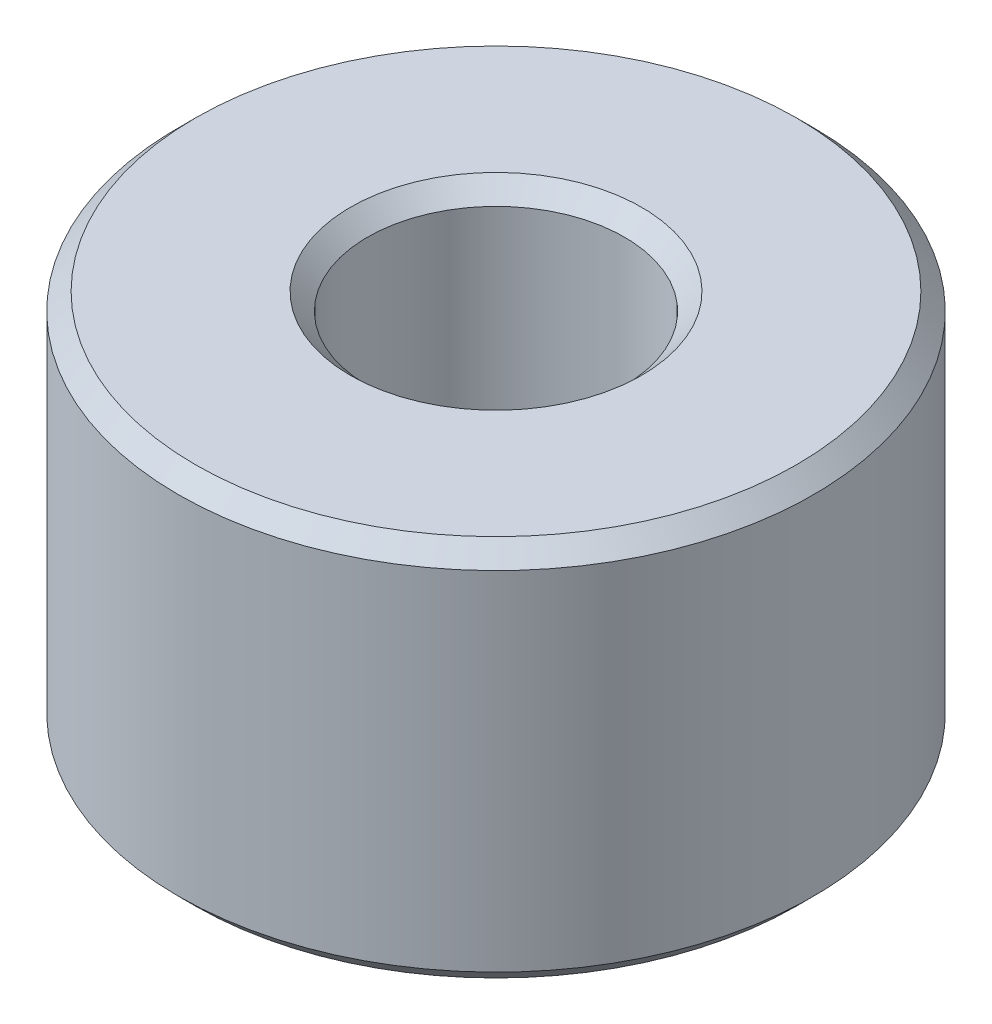
ISO-10303-21;
HEADER;
FILE_DESCRIPTION(('STEP AP214'),'2;1');
FILE_NAME('part.step','',(''),(''),'','','');
FILE_SCHEMA(('AUTOMOTIVE_DESIGN { 1 0 10303 214 1 1 1 1 }'));
ENDSEC;
DATA;
#1=APPLICATION_CONTEXT('core data for automotive mechanical design processes');
#2=APPLICATION_PROTOCOL_DEFINITION('international standard','automotive_design',2000,#1);
#3=PRODUCT_CONTEXT('',#1,'mechanical');
#4=PRODUCT('Part','Part','',(#3));
#5=PRODUCT_RELATED_PRODUCT_CATEGORY('part','',(#4));
#6=PRODUCT_DEFINITION_FORMATION('','',#4);
#7=PRODUCT_DEFINITION_CONTEXT('part definition',#1,'design');
#8=PRODUCT_DEFINITION('design','',#6,#7);
#9=PRODUCT_DEFINITION_SHAPE('','',#8);
#10=(LENGTH_UNIT() NAMED_UNIT(*) SI_UNIT(.MILLI.,.METRE.));
#11=(NAMED_UNIT(*) PLANE_ANGLE_UNIT() SI_UNIT($,.RADIAN.));
#12=(NAMED_UNIT(*) SI_UNIT($,.STERADIAN.) SOLID_ANGLE_UNIT());
#13=UNCERTAINTY_MEASURE_WITH_UNIT(LENGTH_MEASURE(1.E-05),#10,'distance_accuracy_value','');
#14=(GEOMETRIC_REPRESENTATION_CONTEXT(3) GLOBAL_UNCERTAINTY_ASSIGNED_CONTEXT((#13)) GLOBAL_UNIT_ASSIGNED_CONTEXT((#10,
#11,#12)) REPRESENTATION_CONTEXT('',''));
#15=CARTESIAN_POINT('',(0.,0.,0.));
#16=DIRECTION('',(0.,0.,1.));
#17=DIRECTION('',(1.,0.,0.));
#18=AXIS2_PLACEMENT_3D('',#15,#16,#17);
#19=CARTESIAN_POINT('',(0.,66.1699347354592,0.));
#20=DIRECTION('',(0.,-1.,0.));
#21=DIRECTION('',(0.,0.,-1.));
#22=AXIS2_PLACEMENT_3D('',#19,#20,#21);
#23=CYLINDRICAL_SURFACE('',#22,55.);
#24=CARTESIAN_POINT('',(0.,2.98123639031593,0.));
#25=DIRECTION('',(0.,1.,0.));
#26=DIRECTION('',(0.,0.,1.));
#27=AXIS2_PLACEMENT_3D('',#24,#25,#26);
#28=CIRCLE('',#27,55.);
#29=CARTESIAN_POINT('',(0.,2.98123639031593,55.));
#30=VERTEX_POINT('',#29);
#31=EDGE_CURVE('E10',#30,#30,#28,.T.);
#32=ORIENTED_EDGE('',*,*,#31,.T.);
#33=EDGE_LOOP('',(#32));
#34=FACE_BOUND('',#33,.T.);
#35=CARTESIAN_POINT('',(0.,63.1886983451432,0.));
#36=DIRECTION('',(0.,1.,0.));
#37=DIRECTION('',(0.,0.,1.));
#38=AXIS2_PLACEMENT_3D('',#35,#36,#37);
#39=CIRCLE('',#38,55.);
#40=CARTESIAN_POINT('',(0.,63.1886983451432,55.));
#41=VERTEX_POINT('',#40);
#42=EDGE_CURVE('E50',#41,#41,#39,.F.);
#43=ORIENTED_EDGE('',*,*,#42,.T.);
#44=EDGE_LOOP('',(#43));
#45=FACE_BOUND('',#44,.T.);
#46=ADVANCED_FACE('F39',(#34,#45),#23,.T.);
#47=CARTESIAN_POINT('',(0.,66.1699347354592,0.));
#48=DIRECTION('',(0.,1.,0.));
#49=DIRECTION('',(0.,0.,1.));
#50=AXIS2_PLACEMENT_3D('',#47,#48,#49);
#51=PLANE('',#50);
#52=CARTESIAN_POINT('',(0.,66.1699347354592,0.));
#53=DIRECTION('',(0.,1.,0.));
#54=DIRECTION('',(0.,0.,1.));
#55=AXIS2_PLACEMENT_3D('',#52,#53,#54);
#56=CIRCLE('',#55,25.2194158584333);
#57=CARTESIAN_POINT('',(0.,66.1699347354592,25.2194158584333));
#58=VERTEX_POINT('',#57);
#59=EDGE_CURVE('E58',#58,#58,#56,.F.);
#60=ORIENTED_EDGE('',*,*,#59,.T.);
#61=EDGE_LOOP('',(#60));
#62=FACE_BOUND('',#61,.T.);
#63=CARTESIAN_POINT('',(0.,66.1699347354592,0.));
#64=DIRECTION('',(0.,1.,0.));
#65=DIRECTION('',(0.,0.,1.));
#66=AXIS2_PLACEMENT_3D('',#63,#64,#65);
#67=CIRCLE('',#66,52.018763609684);
#68=CARTESIAN_POINT('',(0.,66.1699347354592,52.018763609684));
#69=VERTEX_POINT('',#68);
#70=EDGE_CURVE('E61',#69,#69,#67,.T.);
#71=ORIENTED_EDGE('',*,*,#70,.T.);
#72=EDGE_LOOP('',(#71));
#73=FACE_BOUND('',#72,.T.);
#74=ADVANCED_FACE('F88',(#62,#73),#51,.T.);
#75=CARTESIAN_POINT('',(0.,0.,0.));
#76=DIRECTION('',(0.,1.,0.));
#77=DIRECTION('',(0.,0.,1.));
#78=AXIS2_PLACEMENT_3D('',#75,#76,#77);
#79=PLANE('',#78);
#80=CARTESIAN_POINT('',(0.,0.,0.));
#81=DIRECTION('',(0.,1.,0.));
#82=DIRECTION('',(0.,0.,1.));
#83=AXIS2_PLACEMENT_3D('',#80,#81,#82);
#84=CIRCLE('',#83,25.2194158584332);
#85=CARTESIAN_POINT('',(0.,0.,25.2194158584332));
#86=VERTEX_POINT('',#85);
#87=EDGE_CURVE('E51',#86,#86,#84,.T.);
#88=ORIENTED_EDGE('',*,*,#87,.T.);
#89=EDGE_LOOP('',(#88));
#90=FACE_BOUND('',#89,.T.);
#91=CARTESIAN_POINT('',(0.,0.,0.));
#92=DIRECTION('',(0.,1.,0.));
#93=DIRECTION('',(0.,0.,1.));
#94=AXIS2_PLACEMENT_3D('',#91,#92,#93);
#95=CIRCLE('',#94,52.0187636096841);
#96=CARTESIAN_POINT('',(0.,0.,52.0187636096841));
#97=VERTEX_POINT('',#96);
#98=EDGE_CURVE('E54',#97,#97,#95,.F.);
#99=ORIENTED_EDGE('',*,*,#98,.T.);
#100=EDGE_LOOP('',(#99));
#101=FACE_BOUND('',#100,.T.);
#102=ADVANCED_FACE('F83',(#90,#101),#79,.F.);
#103=CARTESIAN_POINT('',(0.,66.1699347354592,0.));
#104=DIRECTION('',(0.,-1.,0.));
#105=DIRECTION('',(0.,0.,-1.));
#106=AXIS2_PLACEMENT_3D('',#103,#104,#105);
#107=CYLINDRICAL_SURFACE('',#106,22.2381794681173);
#108=CARTESIAN_POINT('',(0.,63.1886983451432,0.));
#109=DIRECTION('',(0.,1.,0.));
#110=DIRECTION('',(0.,0.,1.));
#111=AXIS2_PLACEMENT_3D('',#108,#109,#110);
#112=CIRCLE('',#111,22.2381794681173);
#113=CARTESIAN_POINT('',(0.,63.1886983451432,22.2381794681173));
#114=VERTEX_POINT('',#113);
#115=EDGE_CURVE('E67',#114,#114,#112,.T.);
#116=ORIENTED_EDGE('',*,*,#115,.T.);
#117=EDGE_LOOP('',(#116));
#118=FACE_BOUND('',#117,.T.);
#119=CARTESIAN_POINT('',(0.,2.98123639031593,0.));
#120=DIRECTION('',(0.,1.,0.));
#121=DIRECTION('',(0.,0.,1.));
#122=AXIS2_PLACEMENT_3D('',#119,#120,#121);
#123=CIRCLE('',#122,22.2381794681173);
#124=CARTESIAN_POINT('',(0.,2.98123639031593,22.2381794681173));
#125=VERTEX_POINT('',#124);
#126=EDGE_CURVE('E69',#125,#125,#123,.F.);
#127=ORIENTED_EDGE('',*,*,#126,.T.);
#128=EDGE_LOOP('',(#127));
#129=FACE_BOUND('',#128,.T.);
#130=ADVANCED_FACE('F71',(#118,#129),#107,.F.);
#131=CARTESIAN_POINT('',(0.,63.1886983451432,0.));
#132=DIRECTION('',(0.,1.,0.));
#133=DIRECTION('',(0.,0.,1.));
#134=AXIS2_PLACEMENT_3D('',#131,#132,#133);
#135=CONICAL_SURFACE('',#134,22.2381794681173,0.785398163397452);
#136=ORIENTED_EDGE('',*,*,#59,.F.);
#137=EDGE_LOOP('',(#136));
#138=FACE_BOUND('',#137,.T.);
#139=ORIENTED_EDGE('',*,*,#115,.F.);
#140=EDGE_LOOP('',(#139));
#141=FACE_BOUND('',#140,.T.);
#142=ADVANCED_FACE('F77',(#138,#141),#135,.F.);
#143=CARTESIAN_POINT('',(0.,0.,0.));
#144=DIRECTION('',(0.,-1.,0.));
#145=DIRECTION('',(0.,0.,-1.));
#146=AXIS2_PLACEMENT_3D('',#143,#144,#145);
#147=CONICAL_SURFACE('',#146,25.2194158584332,0.785398163397445);
#148=ORIENTED_EDGE('',*,*,#126,.F.);
#149=EDGE_LOOP('',(#148));
#150=FACE_BOUND('',#149,.T.);
#151=ORIENTED_EDGE('',*,*,#87,.F.);
#152=EDGE_LOOP('',(#151));
#153=FACE_BOUND('',#152,.T.);
#154=ADVANCED_FACE('F73',(#150,#153),#147,.F.);
#155=CARTESIAN_POINT('',(0.,2.98123639031593,0.));
#156=DIRECTION('',(0.,1.,0.));
#157=DIRECTION('',(0.,0.,1.));
#158=AXIS2_PLACEMENT_3D('',#155,#156,#157);
#159=CONICAL_SURFACE('',#158,55.,0.785398163397452);
#160=ORIENTED_EDGE('',*,*,#98,.F.);
#161=EDGE_LOOP('',(#160));
#162=FACE_BOUND('',#161,.T.);
#163=ORIENTED_EDGE('',*,*,#31,.F.);
#164=EDGE_LOOP('',(#163));
#165=FACE_BOUND('',#164,.T.);
#166=ADVANCED_FACE('F76',(#162,#165),#159,.T.);
#167=CARTESIAN_POINT('',(0.,66.1699347354592,0.));
#168=DIRECTION('',(0.,-1.,0.));
#169=DIRECTION('',(0.,0.,-1.));
#170=AXIS2_PLACEMENT_3D('',#167,#168,#169);
#171=CONICAL_SURFACE('',#170,52.018763609684,0.785398163397447);
#172=ORIENTED_EDGE('',*,*,#42,.F.);
#173=EDGE_LOOP('',(#172));
#174=FACE_BOUND('',#173,.T.);
#175=ORIENTED_EDGE('',*,*,#70,.F.);
#176=EDGE_LOOP('',(#175));
#177=FACE_BOUND('',#176,.T.);
#178=ADVANCED_FACE('F45',(#174,#177),#171,.T.);
#179=CLOSED_SHELL('',(#46,#74,#102,#130,#142,#154,#166,#178));
#180=MANIFOLD_SOLID_BREP('B2',#179);
#181=ADVANCED_BREP_SHAPE_REPRESENTATION('',(#18,#180),#14);
#182=SHAPE_DEFINITION_REPRESENTATION(#9,#181);
ENDSEC;
END-ISO-10303-21;
